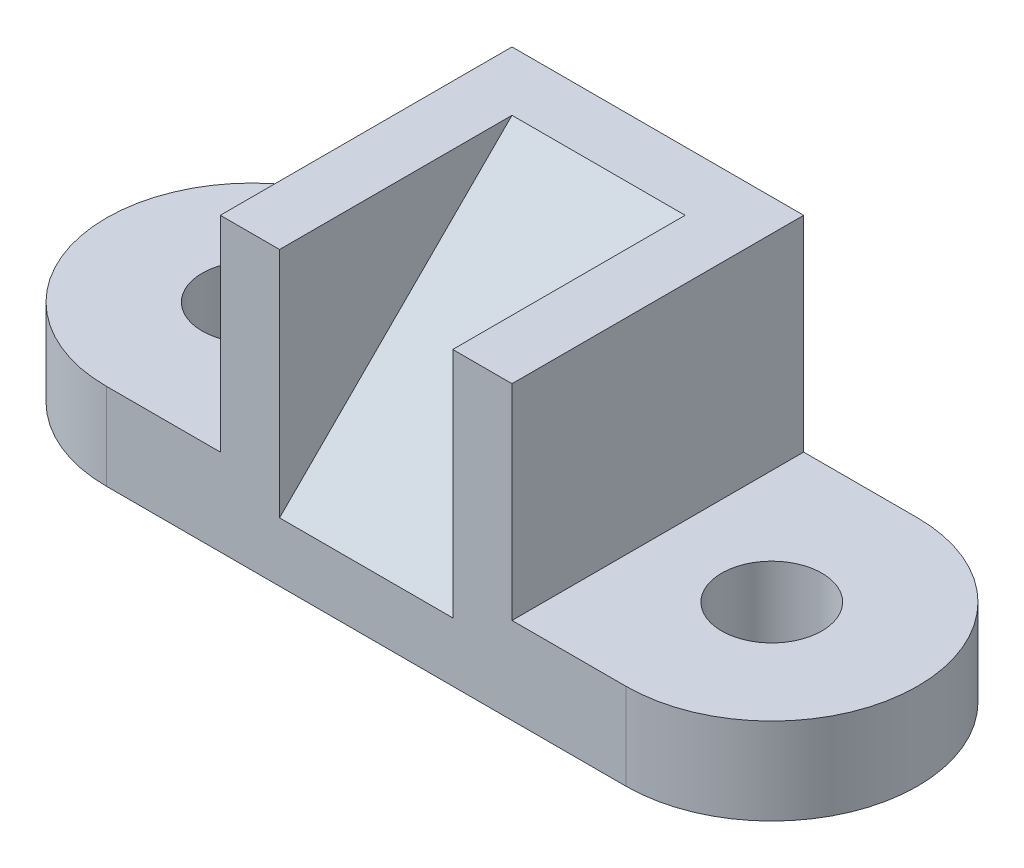
ISO-10303-21;
HEADER;
FILE_DESCRIPTION(('STEP AP214'),'2;1');
FILE_NAME('part.step','',(''),(''),'','','');
FILE_SCHEMA(('AUTOMOTIVE_DESIGN { 1 0 10303 214 1 1 1 1 }'));
ENDSEC;
DATA;
#1=APPLICATION_CONTEXT('core data for automotive mechanical design processes');
#2=APPLICATION_PROTOCOL_DEFINITION('international standard','automotive_design',2000,#1);
#3=PRODUCT_CONTEXT('',#1,'mechanical');
#4=PRODUCT('Part','Part','',(#3));
#5=PRODUCT_RELATED_PRODUCT_CATEGORY('part','',(#4));
#6=PRODUCT_DEFINITION_FORMATION('','',#4);
#7=PRODUCT_DEFINITION_CONTEXT('part definition',#1,'design');
#8=PRODUCT_DEFINITION('design','',#6,#7);
#9=PRODUCT_DEFINITION_SHAPE('','',#8);
#10=(LENGTH_UNIT() NAMED_UNIT(*) SI_UNIT(.MILLI.,.METRE.));
#11=(NAMED_UNIT(*) PLANE_ANGLE_UNIT() SI_UNIT($,.RADIAN.));
#12=(NAMED_UNIT(*) SI_UNIT($,.STERADIAN.) SOLID_ANGLE_UNIT());
#13=UNCERTAINTY_MEASURE_WITH_UNIT(LENGTH_MEASURE(1.E-05),#10,'distance_accuracy_value','');
#14=(GEOMETRIC_REPRESENTATION_CONTEXT(3) GLOBAL_UNCERTAINTY_ASSIGNED_CONTEXT((#13)) GLOBAL_UNIT_ASSIGNED_CONTEXT((#10,
#11,#12)) REPRESENTATION_CONTEXT('',''));
#15=CARTESIAN_POINT('',(0.,0.,0.));
#16=DIRECTION('',(0.,0.,1.));
#17=DIRECTION('',(1.,0.,0.));
#18=AXIS2_PLACEMENT_3D('',#15,#16,#17);
#19=CARTESIAN_POINT('',(76.,64.,0.));
#20=DIRECTION('',(1.,0.,0.));
#21=DIRECTION('',(0.,0.,-1.));
#22=AXIS2_PLACEMENT_3D('',#19,#20,#21);
#23=PLANE('',#22);
#24=DIRECTION('',(0.,0.707106781186547,-0.707106781186547));
#25=VECTOR('',#24,1.);
#26=CARTESIAN_POINT('',(76.,70.5,6.49999999999999));
#27=LINE('',#26,#25);
#28=CARTESIAN_POINT('',(76.,13.,64.));
#29=VERTEX_POINT('',#28);
#30=CARTESIAN_POINT('',(76.,64.,13.));
#31=VERTEX_POINT('',#30);
#32=EDGE_CURVE('E142',#29,#31,#27,.T.);
#33=ORIENTED_EDGE('',*,*,#32,.F.);
#34=DIRECTION('',(0.,-1.,0.));
#35=VECTOR('',#34,1.);
#36=CARTESIAN_POINT('',(76.,64.,64.));
#37=LINE('',#36,#35);
#38=CARTESIAN_POINT('',(76.,64.,64.));
#39=VERTEX_POINT('',#38);
#40=EDGE_CURVE('E128',#39,#29,#37,.T.);
#41=ORIENTED_EDGE('',*,*,#40,.F.);
#42=DIRECTION('',(0.,0.,1.));
#43=VECTOR('',#42,1.);
#44=CARTESIAN_POINT('',(76.,64.,0.));
#45=LINE('',#44,#43);
#46=EDGE_CURVE('E143',#31,#39,#45,.T.);
#47=ORIENTED_EDGE('',*,*,#46,.F.);
#48=EDGE_LOOP('',(#33,#41,#47));
#49=FACE_BOUND('',#48,.T.);
#50=ADVANCED_FACE('F43',(#49),#23,.F.);
#51=CARTESIAN_POINT('',(38.,64.,0.));
#52=DIRECTION('',(-1.,0.,0.));
#53=DIRECTION('',(0.,0.,1.));
#54=AXIS2_PLACEMENT_3D('',#51,#52,#53);
#55=PLANE('',#54);
#56=DIRECTION('',(0.,-0.707106781186547,0.707106781186547));
#57=VECTOR('',#56,1.);
#58=CARTESIAN_POINT('',(38.,64.,13.));
#59=LINE('',#58,#57);
#60=CARTESIAN_POINT('',(38.,64.,13.));
#61=VERTEX_POINT('',#60);
#62=CARTESIAN_POINT('',(38.,13.,64.));
#63=VERTEX_POINT('',#62);
#64=EDGE_CURVE('E147',#61,#63,#59,.T.);
#65=ORIENTED_EDGE('',*,*,#64,.F.);
#66=DIRECTION('',(0.,0.,-1.));
#67=VECTOR('',#66,1.);
#68=CARTESIAN_POINT('',(38.,64.,0.));
#69=LINE('',#68,#67);
#70=CARTESIAN_POINT('',(38.,64.,64.));
#71=VERTEX_POINT('',#70);
#72=EDGE_CURVE('E166',#71,#61,#69,.T.);
#73=ORIENTED_EDGE('',*,*,#72,.F.);
#74=DIRECTION('',(0.,-1.,0.));
#75=VECTOR('',#74,1.);
#76=CARTESIAN_POINT('',(38.,64.,64.));
#77=LINE('',#76,#75);
#78=EDGE_CURVE('E168',#71,#63,#77,.T.);
#79=ORIENTED_EDGE('',*,*,#78,.T.);
#80=EDGE_LOOP('',(#65,#73,#79));
#81=FACE_BOUND('',#80,.T.);
#82=ADVANCED_FACE('F253',(#81),#55,.F.);
#83=CARTESIAN_POINT('',(0.,19.,32.));
#84=DIRECTION('',(0.,-1.,0.));
#85=DIRECTION('',(0.,0.,-1.));
#86=AXIS2_PLACEMENT_3D('',#83,#84,#85);
#87=PLANE('',#86);
#88=CARTESIAN_POINT('',(114.,19.,32.));
#89=DIRECTION('',(0.,1.,0.));
#90=DIRECTION('',(0.,0.,1.));
#91=AXIS2_PLACEMENT_3D('',#88,#89,#90);
#92=CIRCLE('',#91,11.);
#93=CARTESIAN_POINT('',(114.,19.,43.));
#94=VERTEX_POINT('',#93);
#95=EDGE_CURVE('E182',#94,#94,#92,.T.);
#96=ORIENTED_EDGE('',*,*,#95,.F.);
#97=EDGE_LOOP('',(#96));
#98=FACE_BOUND('',#97,.T.);
#99=DIRECTION('',(0.,0.,-1.));
#100=VECTOR('',#99,1.);
#101=CARTESIAN_POINT('',(89.,19.,0.));
#102=LINE('',#101,#100);
#103=CARTESIAN_POINT('',(89.,19.,64.));
#104=VERTEX_POINT('',#103);
#105=CARTESIAN_POINT('',(89.,19.,0.));
#106=VERTEX_POINT('',#105);
#107=EDGE_CURVE('E66',#104,#106,#102,.T.);
#108=ORIENTED_EDGE('',*,*,#107,.F.);
#109=DIRECTION('',(1.,0.,0.));
#110=VECTOR('',#109,1.);
#111=CARTESIAN_POINT('',(114.,19.,64.));
#112=LINE('',#111,#110);
#113=CARTESIAN_POINT('',(114.,19.,64.));
#114=VERTEX_POINT('',#113);
#115=EDGE_CURVE('E197',#104,#114,#112,.T.);
#116=ORIENTED_EDGE('',*,*,#115,.T.);
#117=CARTESIAN_POINT('',(114.,19.,32.));
#118=DIRECTION('',(0.,1.,0.));
#119=DIRECTION('',(0.,0.,-1.));
#120=AXIS2_PLACEMENT_3D('',#117,#118,#119);
#121=CIRCLE('',#120,32.);
#122=CARTESIAN_POINT('',(114.,19.,0.));
#123=VERTEX_POINT('',#122);
#124=EDGE_CURVE('E201',#114,#123,#121,.T.);
#125=ORIENTED_EDGE('',*,*,#124,.T.);
#126=DIRECTION('',(-1.,0.,0.));
#127=VECTOR('',#126,1.);
#128=CARTESIAN_POINT('',(0.,19.,0.));
#129=LINE('',#128,#127);
#130=EDGE_CURVE('E204',#123,#106,#129,.T.);
#131=ORIENTED_EDGE('',*,*,#130,.T.);
#132=EDGE_LOOP('',(#108,#116,#125,#131));
#133=FACE_BOUND('',#132,.T.);
#134=ADVANCED_FACE('F251',(#98,#133),#87,.F.);
#135=CARTESIAN_POINT('',(0.,19.,64.));
#136=VERTEX_POINT('',#135);
#137=CARTESIAN_POINT('',(25.,19.,64.));
#138=VERTEX_POINT('',#137);
#139=EDGE_CURVE('E199',#136,#138,#112,.T.);
#140=ORIENTED_EDGE('',*,*,#139,.T.);
#141=DIRECTION('',(0.,0.,-1.));
#142=VECTOR('',#141,1.);
#143=CARTESIAN_POINT('',(25.,19.,0.));
#144=LINE('',#143,#142);
#145=CARTESIAN_POINT('',(25.,19.,0.));
#146=VERTEX_POINT('',#145);
#147=EDGE_CURVE('E58',#138,#146,#144,.T.);
#148=ORIENTED_EDGE('',*,*,#147,.T.);
#149=CARTESIAN_POINT('',(0.,19.,0.));
#150=VERTEX_POINT('',#149);
#151=EDGE_CURVE('E203',#146,#150,#129,.T.);
#152=ORIENTED_EDGE('',*,*,#151,.T.);
#153=CARTESIAN_POINT('',(0.,19.,32.));
#154=DIRECTION('',(0.,1.,0.));
#155=DIRECTION('',(0.,0.,-1.));
#156=AXIS2_PLACEMENT_3D('',#153,#154,#155);
#157=CIRCLE('',#156,32.);
#158=EDGE_CURVE('E194',#150,#136,#157,.T.);
#159=ORIENTED_EDGE('',*,*,#158,.T.);
#160=EDGE_LOOP('',(#140,#148,#152,#159));
#161=FACE_BOUND('',#160,.T.);
#162=CARTESIAN_POINT('',(0.,19.,32.));
#163=DIRECTION('',(0.,1.,0.));
#164=DIRECTION('',(0.,0.,1.));
#165=AXIS2_PLACEMENT_3D('',#162,#163,#164);
#166=CIRCLE('',#165,11.);
#167=CARTESIAN_POINT('',(0.,19.,43.));
#168=VERTEX_POINT('',#167);
#169=EDGE_CURVE('E188',#168,#168,#166,.T.);
#170=ORIENTED_EDGE('',*,*,#169,.F.);
#171=EDGE_LOOP('',(#170));
#172=FACE_BOUND('',#171,.T.);
#173=ADVANCED_FACE('F238',(#161,#172),#87,.F.);
#174=CARTESIAN_POINT('',(0.,0.,32.));
#175=DIRECTION('',(0.,-1.,0.));
#176=DIRECTION('',(0.,0.,-1.));
#177=AXIS2_PLACEMENT_3D('',#174,#175,#176);
#178=PLANE('',#177);
#179=CARTESIAN_POINT('',(0.,0.,32.));
#180=DIRECTION('',(0.,1.,0.));
#181=DIRECTION('',(0.,0.,1.));
#182=AXIS2_PLACEMENT_3D('',#179,#180,#181);
#183=CIRCLE('',#182,11.);
#184=CARTESIAN_POINT('',(0.,0.,43.));
#185=VERTEX_POINT('',#184);
#186=EDGE_CURVE('E185',#185,#185,#183,.T.);
#187=ORIENTED_EDGE('',*,*,#186,.T.);
#188=EDGE_LOOP('',(#187));
#189=FACE_BOUND('',#188,.T.);
#190=CARTESIAN_POINT('',(0.,0.,32.));
#191=DIRECTION('',(0.,1.,0.));
#192=DIRECTION('',(0.,0.,-1.));
#193=AXIS2_PLACEMENT_3D('',#190,#191,#192);
#194=CIRCLE('',#193,32.);
#195=CARTESIAN_POINT('',(0.,0.,0.));
#196=VERTEX_POINT('',#195);
#197=CARTESIAN_POINT('',(0.,0.,64.));
#198=VERTEX_POINT('',#197);
#199=EDGE_CURVE('E191',#196,#198,#194,.T.);
#200=ORIENTED_EDGE('',*,*,#199,.F.);
#201=DIRECTION('',(-1.,0.,0.));
#202=VECTOR('',#201,1.);
#203=CARTESIAN_POINT('',(0.,0.,0.));
#204=LINE('',#203,#202);
#205=CARTESIAN_POINT('',(114.,0.,0.));
#206=VERTEX_POINT('',#205);
#207=EDGE_CURVE('E198',#206,#196,#204,.T.);
#208=ORIENTED_EDGE('',*,*,#207,.F.);
#209=CARTESIAN_POINT('',(114.,0.,32.));
#210=DIRECTION('',(0.,1.,0.));
#211=DIRECTION('',(0.,0.,-1.));
#212=AXIS2_PLACEMENT_3D('',#209,#210,#211);
#213=CIRCLE('',#212,32.);
#214=CARTESIAN_POINT('',(114.,0.,64.));
#215=VERTEX_POINT('',#214);
#216=EDGE_CURVE('E211',#215,#206,#213,.T.);
#217=ORIENTED_EDGE('',*,*,#216,.F.);
#218=DIRECTION('',(1.,0.,0.));
#219=VECTOR('',#218,1.);
#220=CARTESIAN_POINT('',(114.,0.,64.));
#221=LINE('',#220,#219);
#222=EDGE_CURVE('E209',#198,#215,#221,.T.);
#223=ORIENTED_EDGE('',*,*,#222,.F.);
#224=EDGE_LOOP('',(#200,#208,#217,#223));
#225=FACE_BOUND('',#224,.T.);
#226=CARTESIAN_POINT('',(114.,0.,32.));
#227=DIRECTION('',(0.,1.,0.));
#228=DIRECTION('',(0.,0.,1.));
#229=AXIS2_PLACEMENT_3D('',#226,#227,#228);
#230=CIRCLE('',#229,11.);
#231=CARTESIAN_POINT('',(114.,0.,43.));
#232=VERTEX_POINT('',#231);
#233=EDGE_CURVE('E138',#232,#232,#230,.T.);
#234=ORIENTED_EDGE('',*,*,#233,.T.);
#235=EDGE_LOOP('',(#234));
#236=FACE_BOUND('',#235,.T.);
#237=ADVANCED_FACE('F229',(#189,#225,#236),#178,.T.);
#238=CARTESIAN_POINT('',(0.,19.,32.));
#239=DIRECTION('',(0.,-1.,0.));
#240=DIRECTION('',(0.,0.,-1.));
#241=AXIS2_PLACEMENT_3D('',#238,#239,#240);
#242=CYLINDRICAL_SURFACE('',#241,32.);
#243=ORIENTED_EDGE('',*,*,#199,.T.);
#244=DIRECTION('',(0.,-1.,0.));
#245=VECTOR('',#244,1.);
#246=CARTESIAN_POINT('',(0.,19.,64.));
#247=LINE('',#246,#245);
#248=EDGE_CURVE('E11',#136,#198,#247,.T.);
#249=ORIENTED_EDGE('',*,*,#248,.F.);
#250=ORIENTED_EDGE('',*,*,#158,.F.);
#251=DIRECTION('',(0.,-1.,0.));
#252=VECTOR('',#251,1.);
#253=CARTESIAN_POINT('',(0.,19.,0.));
#254=LINE('',#253,#252);
#255=EDGE_CURVE('E206',#150,#196,#254,.T.);
#256=ORIENTED_EDGE('',*,*,#255,.T.);
#257=EDGE_LOOP('',(#243,#249,#250,#256));
#258=FACE_BOUND('',#257,.T.);
#259=ADVANCED_FACE('F45',(#258),#242,.T.);
#260=CARTESIAN_POINT('',(114.,19.,64.));
#261=DIRECTION('',(0.,0.,-1.));
#262=DIRECTION('',(-1.,0.,0.));
#263=AXIS2_PLACEMENT_3D('',#260,#261,#262);
#264=PLANE('',#263);
#265=DIRECTION('',(1.,0.,0.));
#266=VECTOR('',#265,1.);
#267=CARTESIAN_POINT('',(38.,13.,64.));
#268=LINE('',#267,#266);
#269=EDGE_CURVE('E133',#63,#29,#268,.T.);
#270=ORIENTED_EDGE('',*,*,#269,.F.);
#271=ORIENTED_EDGE('',*,*,#78,.F.);
#272=DIRECTION('',(1.,0.,0.));
#273=VECTOR('',#272,1.);
#274=CARTESIAN_POINT('',(0.,64.,64.));
#275=LINE('',#274,#273);
#276=CARTESIAN_POINT('',(25.,64.,64.));
#277=VERTEX_POINT('',#276);
#278=EDGE_CURVE('E159',#277,#71,#275,.T.);
#279=ORIENTED_EDGE('',*,*,#278,.F.);
#280=DIRECTION('',(0.,-1.,0.));
#281=VECTOR('',#280,1.);
#282=CARTESIAN_POINT('',(25.,64.,64.));
#283=LINE('',#282,#281);
#284=EDGE_CURVE('E172',#277,#138,#283,.T.);
#285=ORIENTED_EDGE('',*,*,#284,.T.);
#286=ORIENTED_EDGE('',*,*,#139,.F.);
#287=ORIENTED_EDGE('',*,*,#248,.T.);
#288=ORIENTED_EDGE('',*,*,#222,.T.);
#289=DIRECTION('',(0.,-1.,0.));
#290=VECTOR('',#289,1.);
#291=CARTESIAN_POINT('',(114.,19.,64.));
#292=LINE('',#291,#290);
#293=EDGE_CURVE('E51',#114,#215,#292,.T.);
#294=ORIENTED_EDGE('',*,*,#293,.F.);
#295=ORIENTED_EDGE('',*,*,#115,.F.);
#296=DIRECTION('',(0.,-1.,0.));
#297=VECTOR('',#296,1.);
#298=CARTESIAN_POINT('',(89.,64.,64.));
#299=LINE('',#298,#297);
#300=CARTESIAN_POINT('',(89.,64.,64.));
#301=VERTEX_POINT('',#300);
#302=EDGE_CURVE('E139',#301,#104,#299,.T.);
#303=ORIENTED_EDGE('',*,*,#302,.F.);
#304=EDGE_CURVE('E136',#39,#301,#275,.T.);
#305=ORIENTED_EDGE('',*,*,#304,.F.);
#306=ORIENTED_EDGE('',*,*,#40,.T.);
#307=EDGE_LOOP('',(#270,#271,#279,#285,#286,#287,#288,#294,#295,#303,#305,#306));
#308=FACE_BOUND('',#307,.T.);
#309=ADVANCED_FACE('F130',(#308),#264,.F.);
#310=CARTESIAN_POINT('',(114.,19.,32.));
#311=DIRECTION('',(0.,-1.,0.));
#312=DIRECTION('',(0.,0.,-1.));
#313=AXIS2_PLACEMENT_3D('',#310,#311,#312);
#314=CYLINDRICAL_SURFACE('',#313,32.);
#315=ORIENTED_EDGE('',*,*,#216,.T.);
#316=DIRECTION('',(0.,-1.,0.));
#317=VECTOR('',#316,1.);
#318=CARTESIAN_POINT('',(114.,19.,0.));
#319=LINE('',#318,#317);
#320=EDGE_CURVE('E216',#123,#206,#319,.T.);
#321=ORIENTED_EDGE('',*,*,#320,.F.);
#322=ORIENTED_EDGE('',*,*,#124,.F.);
#323=ORIENTED_EDGE('',*,*,#293,.T.);
#324=EDGE_LOOP('',(#315,#321,#322,#323));
#325=FACE_BOUND('',#324,.T.);
#326=ADVANCED_FACE('F223',(#325),#314,.T.);
#327=CARTESIAN_POINT('',(0.,19.,0.));
#328=DIRECTION('',(0.,0.,1.));
#329=DIRECTION('',(1.,0.,0.));
#330=AXIS2_PLACEMENT_3D('',#327,#328,#329);
#331=PLANE('',#330);
#332=ORIENTED_EDGE('',*,*,#207,.T.);
#333=ORIENTED_EDGE('',*,*,#255,.F.);
#334=ORIENTED_EDGE('',*,*,#151,.F.);
#335=DIRECTION('',(0.,-1.,0.));
#336=VECTOR('',#335,1.);
#337=CARTESIAN_POINT('',(25.,64.,0.));
#338=LINE('',#337,#336);
#339=CARTESIAN_POINT('',(25.,64.,0.));
#340=VERTEX_POINT('',#339);
#341=EDGE_CURVE('E175',#340,#146,#338,.T.);
#342=ORIENTED_EDGE('',*,*,#341,.F.);
#343=DIRECTION('',(-1.,0.,0.));
#344=VECTOR('',#343,1.);
#345=CARTESIAN_POINT('',(0.,64.,0.));
#346=LINE('',#345,#344);
#347=CARTESIAN_POINT('',(89.,64.,0.));
#348=VERTEX_POINT('',#347);
#349=EDGE_CURVE('E161',#348,#340,#346,.T.);
#350=ORIENTED_EDGE('',*,*,#349,.F.);
#351=DIRECTION('',(0.,-1.,0.));
#352=VECTOR('',#351,1.);
#353=CARTESIAN_POINT('',(89.,64.,0.));
#354=LINE('',#353,#352);
#355=EDGE_CURVE('E178',#348,#106,#354,.T.);
#356=ORIENTED_EDGE('',*,*,#355,.T.);
#357=ORIENTED_EDGE('',*,*,#130,.F.);
#358=ORIENTED_EDGE('',*,*,#320,.T.);
#359=EDGE_LOOP('',(#332,#333,#334,#342,#350,#356,#357,#358));
#360=FACE_BOUND('',#359,.T.);
#361=ADVANCED_FACE('F233',(#360),#331,.F.);
#362=CARTESIAN_POINT('',(0.,19.,32.));
#363=DIRECTION('',(0.,-1.,0.));
#364=DIRECTION('',(0.,0.,-1.));
#365=AXIS2_PLACEMENT_3D('',#362,#363,#364);
#366=CYLINDRICAL_SURFACE('',#365,11.);
#367=ORIENTED_EDGE('',*,*,#169,.T.);
#368=EDGE_LOOP('',(#367));
#369=FACE_BOUND('',#368,.T.);
#370=ORIENTED_EDGE('',*,*,#186,.F.);
#371=EDGE_LOOP('',(#370));
#372=FACE_BOUND('',#371,.T.);
#373=ADVANCED_FACE('F276',(#369,#372),#366,.F.);
#374=CARTESIAN_POINT('',(114.,19.,32.));
#375=DIRECTION('',(0.,-1.,0.));
#376=DIRECTION('',(0.,0.,-1.));
#377=AXIS2_PLACEMENT_3D('',#374,#375,#376);
#378=CYLINDRICAL_SURFACE('',#377,11.);
#379=ORIENTED_EDGE('',*,*,#95,.T.);
#380=EDGE_LOOP('',(#379));
#381=FACE_BOUND('',#380,.T.);
#382=ORIENTED_EDGE('',*,*,#233,.F.);
#383=EDGE_LOOP('',(#382));
#384=FACE_BOUND('',#383,.T.);
#385=ADVANCED_FACE('F274',(#381,#384),#378,.F.);
#386=CARTESIAN_POINT('',(89.,64.,0.));
#387=DIRECTION('',(-1.,0.,0.));
#388=DIRECTION('',(0.,0.,1.));
#389=AXIS2_PLACEMENT_3D('',#386,#387,#388);
#390=PLANE('',#389);
#391=ORIENTED_EDGE('',*,*,#107,.T.);
#392=ORIENTED_EDGE('',*,*,#355,.F.);
#393=DIRECTION('',(0.,0.,-1.));
#394=VECTOR('',#393,1.);
#395=CARTESIAN_POINT('',(89.,64.,0.));
#396=LINE('',#395,#394);
#397=EDGE_CURVE('E158',#301,#348,#396,.T.);
#398=ORIENTED_EDGE('',*,*,#397,.F.);
#399=ORIENTED_EDGE('',*,*,#302,.T.);
#400=EDGE_LOOP('',(#391,#392,#398,#399));
#401=FACE_BOUND('',#400,.T.);
#402=ADVANCED_FACE('F249',(#401),#390,.F.);
#403=CARTESIAN_POINT('',(25.,64.,0.));
#404=DIRECTION('',(-1.,0.,0.));
#405=DIRECTION('',(0.,0.,1.));
#406=AXIS2_PLACEMENT_3D('',#403,#404,#405);
#407=PLANE('',#406);
#408=ORIENTED_EDGE('',*,*,#147,.F.);
#409=ORIENTED_EDGE('',*,*,#284,.F.);
#410=DIRECTION('',(0.,0.,-1.));
#411=VECTOR('',#410,1.);
#412=CARTESIAN_POINT('',(25.,64.,0.));
#413=LINE('',#412,#411);
#414=EDGE_CURVE('E163',#277,#340,#413,.T.);
#415=ORIENTED_EDGE('',*,*,#414,.T.);
#416=ORIENTED_EDGE('',*,*,#341,.T.);
#417=EDGE_LOOP('',(#408,#409,#415,#416));
#418=FACE_BOUND('',#417,.T.);
#419=ADVANCED_FACE('F243',(#418),#407,.T.);
#420=CARTESIAN_POINT('',(0.,64.,0.));
#421=DIRECTION('',(0.,1.,0.));
#422=DIRECTION('',(0.,0.,1.));
#423=AXIS2_PLACEMENT_3D('',#420,#421,#422);
#424=PLANE('',#423);
#425=DIRECTION('',(1.,0.,0.));
#426=VECTOR('',#425,1.);
#427=CARTESIAN_POINT('',(0.,64.,13.));
#428=LINE('',#427,#426);
#429=EDGE_CURVE('E154',#61,#31,#428,.T.);
#430=ORIENTED_EDGE('',*,*,#429,.T.);
#431=ORIENTED_EDGE('',*,*,#46,.T.);
#432=ORIENTED_EDGE('',*,*,#304,.T.);
#433=ORIENTED_EDGE('',*,*,#397,.T.);
#434=ORIENTED_EDGE('',*,*,#349,.T.);
#435=ORIENTED_EDGE('',*,*,#414,.F.);
#436=ORIENTED_EDGE('',*,*,#278,.T.);
#437=ORIENTED_EDGE('',*,*,#72,.T.);
#438=EDGE_LOOP('',(#430,#431,#432,#433,#434,#435,#436,#437));
#439=FACE_BOUND('',#438,.T.);
#440=ADVANCED_FACE('F247',(#439),#424,.T.);
#441=CARTESIAN_POINT('',(89.,64.,13.));
#442=DIRECTION('',(0.,-0.707106781186547,-0.707106781186547));
#443=DIRECTION('',(0.,0.707106781186548,-0.707106781186548));
#444=AXIS2_PLACEMENT_3D('',#441,#442,#443);
#445=PLANE('',#444);
#446=ORIENTED_EDGE('',*,*,#269,.T.);
#447=ORIENTED_EDGE('',*,*,#32,.T.);
#448=ORIENTED_EDGE('',*,*,#429,.F.);
#449=ORIENTED_EDGE('',*,*,#64,.T.);
#450=EDGE_LOOP('',(#446,#447,#448,#449));
#451=FACE_BOUND('',#450,.T.);
#452=ADVANCED_FACE('F149',(#451),#445,.F.);
#453=CLOSED_SHELL('',(#50,#82,#134,#173,#237,#259,#309,#326,#361,#373,#385,#402,#419,#440,#452));
#454=MANIFOLD_SOLID_BREP('B2',#453);
#455=ADVANCED_BREP_SHAPE_REPRESENTATION('',(#18,#454),#14);
#456=SHAPE_DEFINITION_REPRESENTATION(#9,#455);
ENDSEC;
END-ISO-10303-21;
